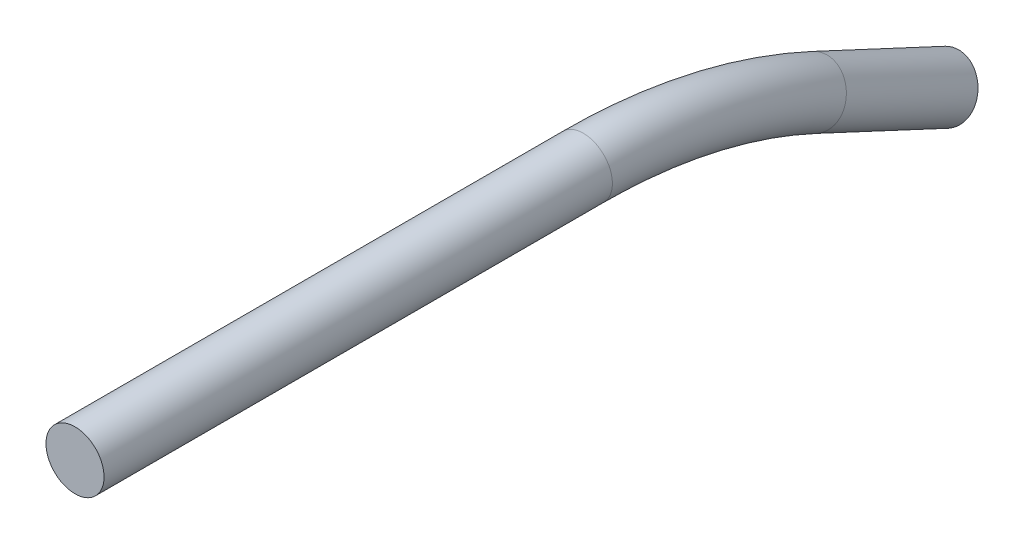
ISO-10303-21;
HEADER;
FILE_DESCRIPTION(('STEP AP214'),'2;1');
FILE_NAME('part.step','',(''),(''),'','','');
FILE_SCHEMA(('AUTOMOTIVE_DESIGN { 1 0 10303 214 1 1 1 1 }'));
ENDSEC;
DATA;
#1=APPLICATION_CONTEXT('core data for automotive mechanical design processes');
#2=APPLICATION_PROTOCOL_DEFINITION('international standard','automotive_design',2000,#1);
#3=PRODUCT_CONTEXT('',#1,'mechanical');
#4=PRODUCT('Part','Part','',(#3));
#5=PRODUCT_RELATED_PRODUCT_CATEGORY('part','',(#4));
#6=PRODUCT_DEFINITION_FORMATION('','',#4);
#7=PRODUCT_DEFINITION_CONTEXT('part definition',#1,'design');
#8=PRODUCT_DEFINITION('design','',#6,#7);
#9=PRODUCT_DEFINITION_SHAPE('','',#8);
#10=(LENGTH_UNIT() NAMED_UNIT(*) SI_UNIT(.MILLI.,.METRE.));
#11=(NAMED_UNIT(*) PLANE_ANGLE_UNIT() SI_UNIT($,.RADIAN.));
#12=(NAMED_UNIT(*) SI_UNIT($,.STERADIAN.) SOLID_ANGLE_UNIT());
#13=UNCERTAINTY_MEASURE_WITH_UNIT(LENGTH_MEASURE(1.E-05),#10,'distance_accuracy_value','');
#14=(GEOMETRIC_REPRESENTATION_CONTEXT(3) GLOBAL_UNCERTAINTY_ASSIGNED_CONTEXT((#13)) GLOBAL_UNIT_ASSIGNED_CONTEXT((#10,
#11,#12)) REPRESENTATION_CONTEXT('',''));
#15=CARTESIAN_POINT('',(0.,0.,0.));
#16=DIRECTION('',(0.,0.,1.));
#17=DIRECTION('',(1.,0.,0.));
#18=AXIS2_PLACEMENT_3D('',#15,#16,#17);
#19=CARTESIAN_POINT('',(6.326,-3.999,-6.02));
#20=DIRECTION('',(0.,0.,1.));
#21=DIRECTION('',(-1.,0.,0.));
#22=AXIS2_PLACEMENT_3D('',#19,#20,#21);
#23=PLANE('',#22);
#24=CARTESIAN_POINT('',(6.125,-4.2,-6.02));
#25=DIRECTION('',(0.,0.,1.));
#26=DIRECTION('',(1.,0.,0.));
#27=AXIS2_PLACEMENT_3D('',#24,#25,#26);
#28=CIRCLE('',#27,0.2);
#29=CARTESIAN_POINT('',(6.325,-4.2,-6.02));
#30=VERTEX_POINT('',#29);
#31=EDGE_CURVE('E31',#30,#30,#28,.F.);
#32=ORIENTED_EDGE('',*,*,#31,.F.);
#33=EDGE_LOOP('',(#32));
#34=FACE_BOUND('',#33,.T.);
#35=ADVANCED_FACE('F15',(#34),#23,.T.);
#36=CARTESIAN_POINT('',(6.125,-4.2,-9.52));
#37=DIRECTION('',(0.,0.,1.));
#38=DIRECTION('',(1.,0.,0.));
#39=AXIS2_PLACEMENT_3D('',#36,#37,#38);
#40=CYLINDRICAL_SURFACE('',#39,0.2);
#41=ORIENTED_EDGE('',*,*,#31,.T.);
#42=EDGE_LOOP('',(#41));
#43=FACE_BOUND('',#42,.T.);
#44=CARTESIAN_POINT('',(6.125,-4.2,-9.52));
#45=DIRECTION('',(0.,0.,-1.));
#46=DIRECTION('',(-1.,0.,0.));
#47=AXIS2_PLACEMENT_3D('',#44,#45,#46);
#48=CIRCLE('',#47,0.199999999999999);
#49=CARTESIAN_POINT('',(5.925,-4.2,-9.52));
#50=VERTEX_POINT('',#49);
#51=EDGE_CURVE('E28',#50,#50,#48,.T.);
#52=ORIENTED_EDGE('',*,*,#51,.F.);
#53=EDGE_LOOP('',(#52));
#54=FACE_BOUND('',#53,.T.);
#55=ADVANCED_FACE('F38',(#43,#54),#40,.T.);
#56=CARTESIAN_POINT('',(5.924,-4.79376345405194,-12.104946270602));
#57=DIRECTION('',(0.,-0.422618261741009,-0.906307787036506));
#58=DIRECTION('',(1.,0.,0.));
#59=AXIS2_PLACEMENT_3D('',#56,#57,#58);
#60=PLANE('',#59);
#61=CARTESIAN_POINT('',(6.125,-4.97593131923963,-12.0199999999952));
#62=DIRECTION('',(0.,0.422618261740962,0.906307787036527));
#63=DIRECTION('',(0.,-0.906307787036527,0.422618261740962));
#64=AXIS2_PLACEMENT_3D('',#61,#62,#63);
#65=CIRCLE('',#64,0.200000000000008);
#66=CARTESIAN_POINT('',(6.125,-5.15719287664694,-11.935476347647));
#67=VERTEX_POINT('',#66);
#68=EDGE_CURVE('E23',#67,#67,#65,.T.);
#69=ORIENTED_EDGE('',*,*,#68,.F.);
#70=EDGE_LOOP('',(#69));
#71=FACE_BOUND('',#70,.T.);
#72=ADVANCED_FACE('F40',(#71),#60,.T.);
#73=CARTESIAN_POINT('',(6.125,-7.97099703729429,-9.52000000001683));
#74=DIRECTION('',(1.,0.,0.));
#75=DIRECTION('',(0.,0.,-1.));
#76=AXIS2_PLACEMENT_3D('',#73,#74,#75);
#77=TOROIDAL_SURFACE('',#76,3.77099703729429,0.200000000000008);
#78=CARTESIAN_POINT('',(6.125,-4.55331305751668,-11.1136922129969));
#79=DIRECTION('',(0.,-0.422618261740942,-0.906307787036537));
#80=DIRECTION('',(0.,0.906307787036537,-0.422618261740942));
#81=AXIS2_PLACEMENT_3D('',#78,#79,#80);
#82=CIRCLE('',#81,0.200000000000007);
#83=CARTESIAN_POINT('',(6.125,-4.37205150010937,-11.1982158653451));
#84=VERTEX_POINT('',#83);
#85=EDGE_CURVE('E10',#84,#84,#82,.T.);
#86=ORIENTED_EDGE('',*,*,#85,.F.);
#87=EDGE_LOOP('',(#86));
#88=FACE_BOUND('',#87,.T.);
#89=ORIENTED_EDGE('',*,*,#51,.T.);
#90=EDGE_LOOP('',(#89));
#91=FACE_BOUND('',#90,.T.);
#92=ADVANCED_FACE('F36',(#88,#91),#77,.T.);
#93=CARTESIAN_POINT('',(6.125,-4.97593131924333,-12.0200000000031));
#94=DIRECTION('',(0.,0.422618261740962,0.906307787036527));
#95=DIRECTION('',(0.,-0.906307787036527,0.422618261740962));
#96=AXIS2_PLACEMENT_3D('',#93,#94,#95);
#97=CYLINDRICAL_SURFACE('',#96,0.200000000000008);
#98=ORIENTED_EDGE('',*,*,#85,.T.);
#99=EDGE_LOOP('',(#98));
#100=FACE_BOUND('',#99,.T.);
#101=ORIENTED_EDGE('',*,*,#68,.T.);
#102=EDGE_LOOP('',(#101));
#103=FACE_BOUND('',#102,.T.);
#104=ADVANCED_FACE('F17',(#100,#103),#97,.T.);
#105=CLOSED_SHELL('',(#35,#55,#72,#92,#104));
#106=MANIFOLD_SOLID_BREP('B1',#105);
#107=ADVANCED_BREP_SHAPE_REPRESENTATION('',(#18,#106),#14);
#108=SHAPE_DEFINITION_REPRESENTATION(#9,#107);
ENDSEC;
END-ISO-10303-21;
